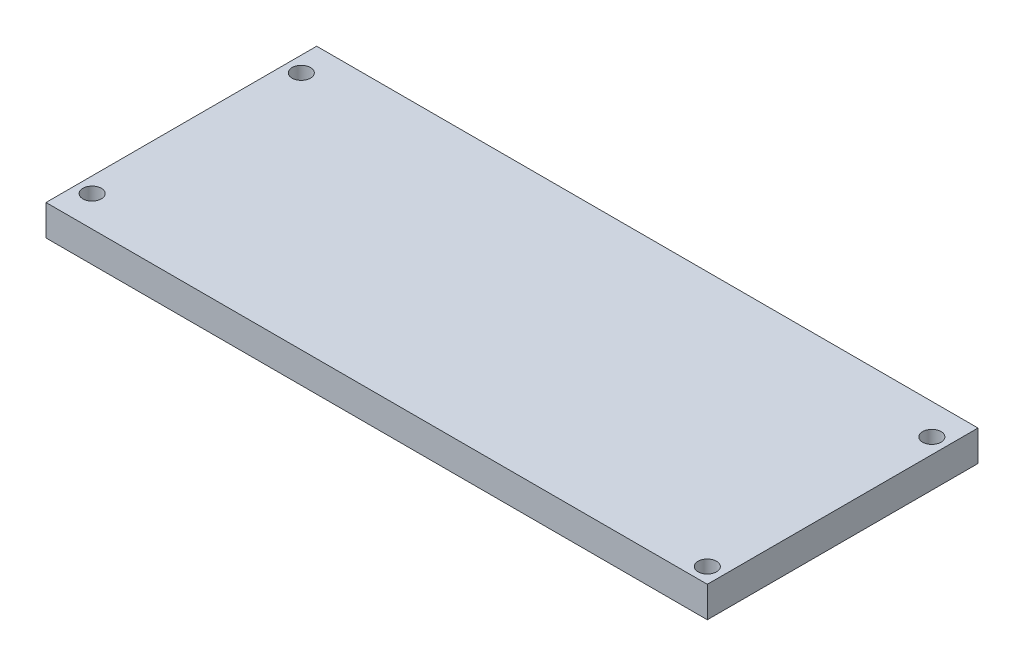
ISO-10303-21;
HEADER;
FILE_DESCRIPTION(('STEP AP214'),'2;1');
FILE_NAME('part.step','',(''),(''),'','','');
FILE_SCHEMA(('AUTOMOTIVE_DESIGN { 1 0 10303 214 1 1 1 1 }'));
ENDSEC;
DATA;
#1=APPLICATION_CONTEXT('core data for automotive mechanical design processes');
#2=APPLICATION_PROTOCOL_DEFINITION('international standard','automotive_design',2000,#1);
#3=PRODUCT_CONTEXT('',#1,'mechanical');
#4=PRODUCT('Part','Part','',(#3));
#5=PRODUCT_RELATED_PRODUCT_CATEGORY('part','',(#4));
#6=PRODUCT_DEFINITION_FORMATION('','',#4);
#7=PRODUCT_DEFINITION_CONTEXT('part definition',#1,'design');
#8=PRODUCT_DEFINITION('design','',#6,#7);
#9=PRODUCT_DEFINITION_SHAPE('','',#8);
#10=(LENGTH_UNIT() NAMED_UNIT(*) SI_UNIT(.MILLI.,.METRE.));
#11=(NAMED_UNIT(*) PLANE_ANGLE_UNIT() SI_UNIT($,.RADIAN.));
#12=(NAMED_UNIT(*) SI_UNIT($,.STERADIAN.) SOLID_ANGLE_UNIT());
#13=UNCERTAINTY_MEASURE_WITH_UNIT(LENGTH_MEASURE(1.E-05),#10,'distance_accuracy_value','');
#14=(GEOMETRIC_REPRESENTATION_CONTEXT(3) GLOBAL_UNCERTAINTY_ASSIGNED_CONTEXT((#13)) GLOBAL_UNIT_ASSIGNED_CONTEXT((#10,
#11,#12)) REPRESENTATION_CONTEXT('',''));
#15=CARTESIAN_POINT('',(0.,0.,0.));
#16=DIRECTION('',(0.,0.,1.));
#17=DIRECTION('',(1.,0.,0.));
#18=AXIS2_PLACEMENT_3D('',#15,#16,#17);
#19=CARTESIAN_POINT('',(0.,10.,0.));
#20=DIRECTION('',(0.,1.,0.));
#21=DIRECTION('',(0.,0.,1.));
#22=AXIS2_PLACEMENT_3D('',#19,#20,#21);
#23=PLANE('',#22);
#24=CARTESIAN_POINT('',(210.,10.,-78.));
#25=DIRECTION('',(0.,1.,0.));
#26=DIRECTION('',(0.,0.,1.));
#27=AXIS2_PLACEMENT_3D('',#24,#25,#26);
#28=CIRCLE('',#27,2.99999999999999);
#29=CARTESIAN_POINT('',(210.,10.,-75.));
#30=VERTEX_POINT('',#29);
#31=EDGE_CURVE('E130',#30,#30,#28,.T.);
#32=ORIENTED_EDGE('',*,*,#31,.F.);
#33=EDGE_LOOP('',(#32));
#34=FACE_BOUND('',#33,.T.);
#35=CARTESIAN_POINT('',(5.,10.,-10.));
#36=DIRECTION('',(0.,1.,0.));
#37=DIRECTION('',(0.,0.,1.));
#38=AXIS2_PLACEMENT_3D('',#35,#36,#37);
#39=CIRCLE('',#38,3.);
#40=CARTESIAN_POINT('',(5.,10.,-7.));
#41=VERTEX_POINT('',#40);
#42=EDGE_CURVE('E131',#41,#41,#39,.T.);
#43=ORIENTED_EDGE('',*,*,#42,.F.);
#44=EDGE_LOOP('',(#43));
#45=FACE_BOUND('',#44,.T.);
#46=DIRECTION('',(0.,0.,1.));
#47=VECTOR('',#46,1.);
#48=CARTESIAN_POINT('',(0.,10.,-88.));
#49=LINE('',#48,#47);
#50=CARTESIAN_POINT('',(0.,10.,-88.));
#51=VERTEX_POINT('',#50);
#52=CARTESIAN_POINT('',(0.,10.,0.));
#53=VERTEX_POINT('',#52);
#54=EDGE_CURVE('E93',#51,#53,#49,.T.);
#55=ORIENTED_EDGE('',*,*,#54,.T.);
#56=DIRECTION('',(1.,0.,0.));
#57=VECTOR('',#56,1.);
#58=CARTESIAN_POINT('',(0.,10.,0.));
#59=LINE('',#58,#57);
#60=CARTESIAN_POINT('',(215.,10.,0.));
#61=VERTEX_POINT('',#60);
#62=EDGE_CURVE('E88',#53,#61,#59,.T.);
#63=ORIENTED_EDGE('',*,*,#62,.T.);
#64=DIRECTION('',(0.,0.,-1.));
#65=VECTOR('',#64,1.);
#66=CARTESIAN_POINT('',(215.,10.,-88.));
#67=LINE('',#66,#65);
#68=CARTESIAN_POINT('',(215.,10.,-88.));
#69=VERTEX_POINT('',#68);
#70=EDGE_CURVE('E91',#61,#69,#67,.T.);
#71=ORIENTED_EDGE('',*,*,#70,.T.);
#72=DIRECTION('',(-1.,0.,0.));
#73=VECTOR('',#72,1.);
#74=CARTESIAN_POINT('',(0.,10.,-88.));
#75=LINE('',#74,#73);
#76=EDGE_CURVE('E58',#69,#51,#75,.T.);
#77=ORIENTED_EDGE('',*,*,#76,.T.);
#78=EDGE_LOOP('',(#55,#63,#71,#77));
#79=FACE_BOUND('',#78,.T.);
#80=CARTESIAN_POINT('',(5.,10.,-78.));
#81=DIRECTION('',(0.,1.,0.));
#82=DIRECTION('',(0.,0.,1.));
#83=AXIS2_PLACEMENT_3D('',#80,#81,#82);
#84=CIRCLE('',#83,3.);
#85=CARTESIAN_POINT('',(5.,10.,-75.));
#86=VERTEX_POINT('',#85);
#87=EDGE_CURVE('E117',#86,#86,#84,.T.);
#88=ORIENTED_EDGE('',*,*,#87,.F.);
#89=EDGE_LOOP('',(#88));
#90=FACE_BOUND('',#89,.T.);
#91=CARTESIAN_POINT('',(210.,10.,-5.));
#92=DIRECTION('',(0.,1.,0.));
#93=DIRECTION('',(0.,0.,1.));
#94=AXIS2_PLACEMENT_3D('',#91,#92,#93);
#95=CIRCLE('',#94,2.99999999999999);
#96=CARTESIAN_POINT('',(210.,10.,-2.00000000000001));
#97=VERTEX_POINT('',#96);
#98=EDGE_CURVE('E166',#97,#97,#95,.T.);
#99=ORIENTED_EDGE('',*,*,#98,.F.);
#100=EDGE_LOOP('',(#99));
#101=FACE_BOUND('',#100,.T.);
#102=ADVANCED_FACE('F40',(#34,#45,#79,#90,#101),#23,.T.);
#103=CARTESIAN_POINT('',(0.,0.,0.));
#104=DIRECTION('',(0.,1.,0.));
#105=DIRECTION('',(0.,0.,1.));
#106=AXIS2_PLACEMENT_3D('',#103,#104,#105);
#107=PLANE('',#106);
#108=DIRECTION('',(0.,0.,1.));
#109=VECTOR('',#108,1.);
#110=CARTESIAN_POINT('',(0.,0.,-88.));
#111=LINE('',#110,#109);
#112=CARTESIAN_POINT('',(0.,0.,-88.));
#113=VERTEX_POINT('',#112);
#114=CARTESIAN_POINT('',(0.,0.,0.));
#115=VERTEX_POINT('',#114);
#116=EDGE_CURVE('E136',#113,#115,#111,.T.);
#117=ORIENTED_EDGE('',*,*,#116,.F.);
#118=DIRECTION('',(-1.,0.,0.));
#119=VECTOR('',#118,1.);
#120=CARTESIAN_POINT('',(0.,0.,-88.));
#121=LINE('',#120,#119);
#122=CARTESIAN_POINT('',(215.,0.,-88.));
#123=VERTEX_POINT('',#122);
#124=EDGE_CURVE('E81',#123,#113,#121,.T.);
#125=ORIENTED_EDGE('',*,*,#124,.F.);
#126=DIRECTION('',(0.,0.,-1.));
#127=VECTOR('',#126,1.);
#128=CARTESIAN_POINT('',(215.,0.,-88.));
#129=LINE('',#128,#127);
#130=CARTESIAN_POINT('',(215.,0.,0.));
#131=VERTEX_POINT('',#130);
#132=EDGE_CURVE('E75',#131,#123,#129,.T.);
#133=ORIENTED_EDGE('',*,*,#132,.F.);
#134=DIRECTION('',(1.,0.,0.));
#135=VECTOR('',#134,1.);
#136=CARTESIAN_POINT('',(0.,0.,0.));
#137=LINE('',#136,#135);
#138=EDGE_CURVE('E98',#115,#131,#137,.T.);
#139=ORIENTED_EDGE('',*,*,#138,.F.);
#140=EDGE_LOOP('',(#117,#125,#133,#139));
#141=FACE_BOUND('',#140,.T.);
#142=CARTESIAN_POINT('',(5.,0.,-10.));
#143=DIRECTION('',(0.,1.,0.));
#144=DIRECTION('',(0.,0.,1.));
#145=AXIS2_PLACEMENT_3D('',#142,#143,#144);
#146=CIRCLE('',#145,3.);
#147=CARTESIAN_POINT('',(5.,0.,-7.));
#148=VERTEX_POINT('',#147);
#149=EDGE_CURVE('E123',#148,#148,#146,.T.);
#150=ORIENTED_EDGE('',*,*,#149,.T.);
#151=EDGE_LOOP('',(#150));
#152=FACE_BOUND('',#151,.T.);
#153=CARTESIAN_POINT('',(5.,0.,-78.));
#154=DIRECTION('',(0.,1.,0.));
#155=DIRECTION('',(0.,0.,1.));
#156=AXIS2_PLACEMENT_3D('',#153,#154,#155);
#157=CIRCLE('',#156,3.);
#158=CARTESIAN_POINT('',(5.,0.,-75.));
#159=VERTEX_POINT('',#158);
#160=EDGE_CURVE('E124',#159,#159,#157,.T.);
#161=ORIENTED_EDGE('',*,*,#160,.T.);
#162=EDGE_LOOP('',(#161));
#163=FACE_BOUND('',#162,.T.);
#164=CARTESIAN_POINT('',(210.,0.,-78.));
#165=DIRECTION('',(0.,1.,0.));
#166=DIRECTION('',(0.,0.,1.));
#167=AXIS2_PLACEMENT_3D('',#164,#165,#166);
#168=CIRCLE('',#167,2.99999999999999);
#169=CARTESIAN_POINT('',(210.,0.,-75.));
#170=VERTEX_POINT('',#169);
#171=EDGE_CURVE('E125',#170,#170,#168,.T.);
#172=ORIENTED_EDGE('',*,*,#171,.T.);
#173=EDGE_LOOP('',(#172));
#174=FACE_BOUND('',#173,.T.);
#175=CARTESIAN_POINT('',(210.,0.,-5.));
#176=DIRECTION('',(0.,1.,0.));
#177=DIRECTION('',(0.,0.,1.));
#178=AXIS2_PLACEMENT_3D('',#175,#176,#177);
#179=CIRCLE('',#178,2.99999999999999);
#180=CARTESIAN_POINT('',(210.,0.,-2.00000000000001));
#181=VERTEX_POINT('',#180);
#182=EDGE_CURVE('E169',#181,#181,#179,.T.);
#183=ORIENTED_EDGE('',*,*,#182,.T.);
#184=EDGE_LOOP('',(#183));
#185=FACE_BOUND('',#184,.T.);
#186=ADVANCED_FACE('F153',(#141,#152,#163,#174,#185),#107,.F.);
#187=CARTESIAN_POINT('',(0.,10.,-88.));
#188=DIRECTION('',(1.,0.,0.));
#189=DIRECTION('',(0.,0.,-1.));
#190=AXIS2_PLACEMENT_3D('',#187,#188,#189);
#191=PLANE('',#190);
#192=ORIENTED_EDGE('',*,*,#116,.T.);
#193=DIRECTION('',(0.,-1.,0.));
#194=VECTOR('',#193,1.);
#195=CARTESIAN_POINT('',(0.,10.,0.));
#196=LINE('',#195,#194);
#197=EDGE_CURVE('E12',#53,#115,#196,.T.);
#198=ORIENTED_EDGE('',*,*,#197,.F.);
#199=ORIENTED_EDGE('',*,*,#54,.F.);
#200=DIRECTION('',(0.,-1.,0.));
#201=VECTOR('',#200,1.);
#202=CARTESIAN_POINT('',(0.,10.,-88.));
#203=LINE('',#202,#201);
#204=EDGE_CURVE('E105',#51,#113,#203,.T.);
#205=ORIENTED_EDGE('',*,*,#204,.T.);
#206=EDGE_LOOP('',(#192,#198,#199,#205));
#207=FACE_BOUND('',#206,.T.);
#208=ADVANCED_FACE('F42',(#207),#191,.F.);
#209=CARTESIAN_POINT('',(0.,10.,0.));
#210=DIRECTION('',(0.,0.,-1.));
#211=DIRECTION('',(-1.,0.,0.));
#212=AXIS2_PLACEMENT_3D('',#209,#210,#211);
#213=PLANE('',#212);
#214=ORIENTED_EDGE('',*,*,#138,.T.);
#215=DIRECTION('',(0.,-1.,0.));
#216=VECTOR('',#215,1.);
#217=CARTESIAN_POINT('',(215.,10.,0.));
#218=LINE('',#217,#216);
#219=EDGE_CURVE('E50',#61,#131,#218,.T.);
#220=ORIENTED_EDGE('',*,*,#219,.F.);
#221=ORIENTED_EDGE('',*,*,#62,.F.);
#222=ORIENTED_EDGE('',*,*,#197,.T.);
#223=EDGE_LOOP('',(#214,#220,#221,#222));
#224=FACE_BOUND('',#223,.T.);
#225=ADVANCED_FACE('F97',(#224),#213,.F.);
#226=CARTESIAN_POINT('',(215.,10.,-88.));
#227=DIRECTION('',(-1.,0.,0.));
#228=DIRECTION('',(0.,0.,1.));
#229=AXIS2_PLACEMENT_3D('',#226,#227,#228);
#230=PLANE('',#229);
#231=ORIENTED_EDGE('',*,*,#132,.T.);
#232=DIRECTION('',(0.,-1.,0.));
#233=VECTOR('',#232,1.);
#234=CARTESIAN_POINT('',(215.,10.,-88.));
#235=LINE('',#234,#233);
#236=EDGE_CURVE('E100',#69,#123,#235,.T.);
#237=ORIENTED_EDGE('',*,*,#236,.F.);
#238=ORIENTED_EDGE('',*,*,#70,.F.);
#239=ORIENTED_EDGE('',*,*,#219,.T.);
#240=EDGE_LOOP('',(#231,#237,#238,#239));
#241=FACE_BOUND('',#240,.T.);
#242=ADVANCED_FACE('F101',(#241),#230,.F.);
#243=CARTESIAN_POINT('',(0.,10.,-88.));
#244=DIRECTION('',(0.,0.,1.));
#245=DIRECTION('',(1.,0.,0.));
#246=AXIS2_PLACEMENT_3D('',#243,#244,#245);
#247=PLANE('',#246);
#248=ORIENTED_EDGE('',*,*,#124,.T.);
#249=ORIENTED_EDGE('',*,*,#204,.F.);
#250=ORIENTED_EDGE('',*,*,#76,.F.);
#251=ORIENTED_EDGE('',*,*,#236,.T.);
#252=EDGE_LOOP('',(#248,#249,#250,#251));
#253=FACE_BOUND('',#252,.T.);
#254=ADVANCED_FACE('F150',(#253),#247,.F.);
#255=CARTESIAN_POINT('',(5.,10.,-10.));
#256=DIRECTION('',(0.,-1.,0.));
#257=DIRECTION('',(0.,0.,-1.));
#258=AXIS2_PLACEMENT_3D('',#255,#256,#257);
#259=CYLINDRICAL_SURFACE('',#258,3.);
#260=ORIENTED_EDGE('',*,*,#42,.T.);
#261=EDGE_LOOP('',(#260));
#262=FACE_BOUND('',#261,.T.);
#263=ORIENTED_EDGE('',*,*,#149,.F.);
#264=EDGE_LOOP('',(#263));
#265=FACE_BOUND('',#264,.T.);
#266=ADVANCED_FACE('F198',(#262,#265),#259,.F.);
#267=CARTESIAN_POINT('',(5.,10.,-78.));
#268=DIRECTION('',(0.,-1.,0.));
#269=DIRECTION('',(0.,0.,-1.));
#270=AXIS2_PLACEMENT_3D('',#267,#268,#269);
#271=CYLINDRICAL_SURFACE('',#270,3.);
#272=ORIENTED_EDGE('',*,*,#87,.T.);
#273=EDGE_LOOP('',(#272));
#274=FACE_BOUND('',#273,.T.);
#275=ORIENTED_EDGE('',*,*,#160,.F.);
#276=EDGE_LOOP('',(#275));
#277=FACE_BOUND('',#276,.T.);
#278=ADVANCED_FACE('F185',(#274,#277),#271,.F.);
#279=CARTESIAN_POINT('',(210.,10.,-78.));
#280=DIRECTION('',(0.,-1.,0.));
#281=DIRECTION('',(0.,0.,-1.));
#282=AXIS2_PLACEMENT_3D('',#279,#280,#281);
#283=CYLINDRICAL_SURFACE('',#282,2.99999999999999);
#284=ORIENTED_EDGE('',*,*,#31,.T.);
#285=EDGE_LOOP('',(#284));
#286=FACE_BOUND('',#285,.T.);
#287=ORIENTED_EDGE('',*,*,#171,.F.);
#288=EDGE_LOOP('',(#287));
#289=FACE_BOUND('',#288,.T.);
#290=ADVANCED_FACE('F179',(#286,#289),#283,.F.);
#291=CARTESIAN_POINT('',(210.,10.,-5.));
#292=DIRECTION('',(0.,-1.,0.));
#293=DIRECTION('',(0.,0.,-1.));
#294=AXIS2_PLACEMENT_3D('',#291,#292,#293);
#295=CYLINDRICAL_SURFACE('',#294,2.99999999999999);
#296=ORIENTED_EDGE('',*,*,#98,.T.);
#297=EDGE_LOOP('',(#296));
#298=FACE_BOUND('',#297,.T.);
#299=ORIENTED_EDGE('',*,*,#182,.F.);
#300=EDGE_LOOP('',(#299));
#301=FACE_BOUND('',#300,.T.);
#302=ADVANCED_FACE('F177',(#298,#301),#295,.F.);
#303=CLOSED_SHELL('',(#102,#186,#208,#225,#242,#254,#266,#278,#290,#302));
#304=MANIFOLD_SOLID_BREP('B2',#303);
#305=ADVANCED_BREP_SHAPE_REPRESENTATION('',(#18,#304),#14);
#306=SHAPE_DEFINITION_REPRESENTATION(#9,#305);
ENDSEC;
END-ISO-10303-21;
